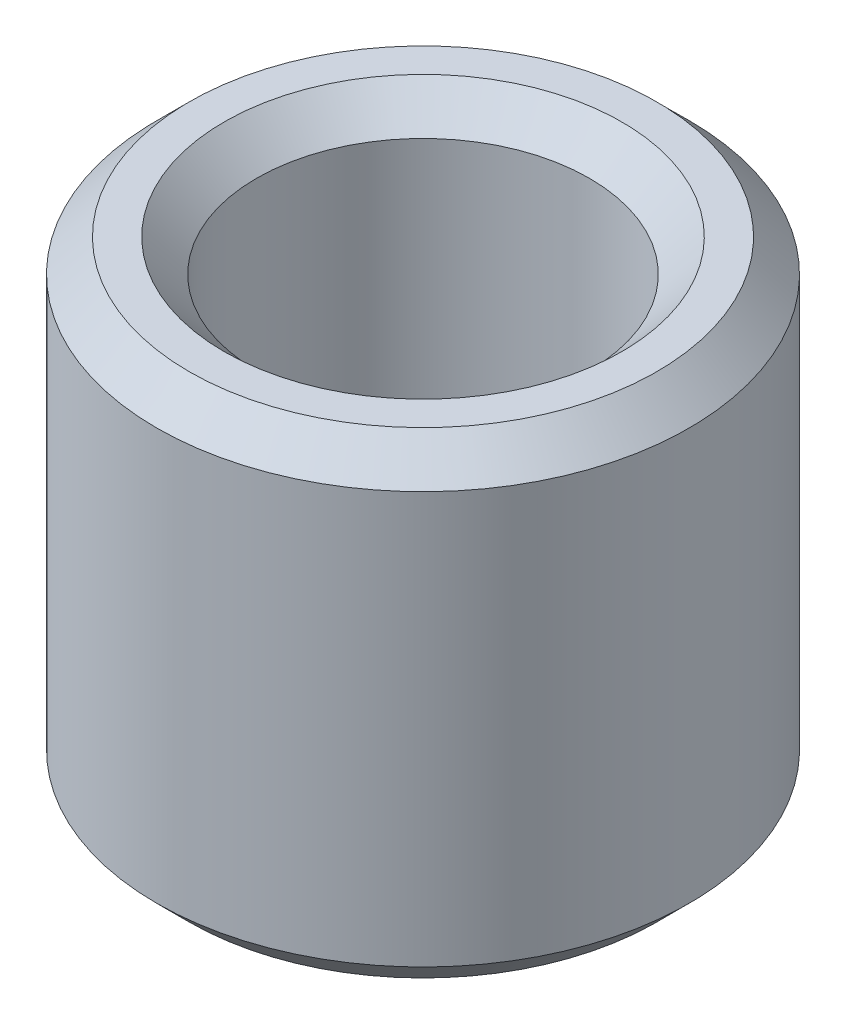
ISO-10303-21;
HEADER;
FILE_DESCRIPTION(('STEP AP214'),'2;1');
FILE_NAME('part.step','',(''),(''),'','','');
FILE_SCHEMA(('AUTOMOTIVE_DESIGN { 1 0 10303 214 1 1 1 1 }'));
ENDSEC;
DATA;
#1=APPLICATION_CONTEXT('core data for automotive mechanical design processes');
#2=APPLICATION_PROTOCOL_DEFINITION('international standard','automotive_design',2000,#1);
#3=PRODUCT_CONTEXT('',#1,'mechanical');
#4=PRODUCT('Part','Part','',(#3));
#5=PRODUCT_RELATED_PRODUCT_CATEGORY('part','',(#4));
#6=PRODUCT_DEFINITION_FORMATION('','',#4);
#7=PRODUCT_DEFINITION_CONTEXT('part definition',#1,'design');
#8=PRODUCT_DEFINITION('design','',#6,#7);
#9=PRODUCT_DEFINITION_SHAPE('','',#8);
#10=(LENGTH_UNIT() NAMED_UNIT(*) SI_UNIT(.MILLI.,.METRE.));
#11=(NAMED_UNIT(*) PLANE_ANGLE_UNIT() SI_UNIT($,.RADIAN.));
#12=(NAMED_UNIT(*) SI_UNIT($,.STERADIAN.) SOLID_ANGLE_UNIT());
#13=UNCERTAINTY_MEASURE_WITH_UNIT(LENGTH_MEASURE(1.E-05),#10,'distance_accuracy_value','');
#14=(GEOMETRIC_REPRESENTATION_CONTEXT(3) GLOBAL_UNCERTAINTY_ASSIGNED_CONTEXT((#13)) GLOBAL_UNIT_ASSIGNED_CONTEXT((#10,
#11,#12)) REPRESENTATION_CONTEXT('',''));
#15=CARTESIAN_POINT('',(0.,0.,0.));
#16=DIRECTION('',(0.,0.,1.));
#17=DIRECTION('',(1.,0.,0.));
#18=AXIS2_PLACEMENT_3D('',#15,#16,#17);
#19=CARTESIAN_POINT('',(0.,40.2782778000983,0.));
#20=DIRECTION('',(0.,-1.,0.));
#21=DIRECTION('',(0.,0.,-1.));
#22=AXIS2_PLACEMENT_3D('',#19,#20,#21);
#23=CYLINDRICAL_SURFACE('',#22,22.5);
#24=CARTESIAN_POINT('',(0.,2.74655692665027,0.));
#25=DIRECTION('',(0.,1.,0.));
#26=DIRECTION('',(0.,0.,1.));
#27=AXIS2_PLACEMENT_3D('',#24,#25,#26);
#28=CIRCLE('',#27,22.5);
#29=CARTESIAN_POINT('',(0.,2.74655692665027,22.5));
#30=VERTEX_POINT('',#29);
#31=EDGE_CURVE('E10',#30,#30,#28,.T.);
#32=ORIENTED_EDGE('',*,*,#31,.T.);
#33=EDGE_LOOP('',(#32));
#34=FACE_BOUND('',#33,.T.);
#35=CARTESIAN_POINT('',(0.,37.531720873448,0.));
#36=DIRECTION('',(0.,1.,0.));
#37=DIRECTION('',(0.,0.,1.));
#38=AXIS2_PLACEMENT_3D('',#35,#36,#37);
#39=CIRCLE('',#38,22.5);
#40=CARTESIAN_POINT('',(0.,37.531720873448,22.5));
#41=VERTEX_POINT('',#40);
#42=EDGE_CURVE('E50',#41,#41,#39,.F.);
#43=ORIENTED_EDGE('',*,*,#42,.T.);
#44=EDGE_LOOP('',(#43));
#45=FACE_BOUND('',#44,.T.);
#46=ADVANCED_FACE('F39',(#34,#45),#23,.T.);
#47=CARTESIAN_POINT('',(0.,40.2782778000983,0.));
#48=DIRECTION('',(0.,1.,0.));
#49=DIRECTION('',(0.,0.,1.));
#50=AXIS2_PLACEMENT_3D('',#47,#48,#49);
#51=PLANE('',#50);
#52=CARTESIAN_POINT('',(0.,40.2782778000983,0.));
#53=DIRECTION('',(0.,1.,0.));
#54=DIRECTION('',(0.,0.,1.));
#55=AXIS2_PLACEMENT_3D('',#52,#53,#54);
#56=CIRCLE('',#55,16.8094867861536);
#57=CARTESIAN_POINT('',(0.,40.2782778000983,16.8094867861536));
#58=VERTEX_POINT('',#57);
#59=EDGE_CURVE('E58',#58,#58,#56,.F.);
#60=ORIENTED_EDGE('',*,*,#59,.T.);
#61=EDGE_LOOP('',(#60));
#62=FACE_BOUND('',#61,.T.);
#63=CARTESIAN_POINT('',(0.,40.2782778000983,0.));
#64=DIRECTION('',(0.,1.,0.));
#65=DIRECTION('',(0.,0.,1.));
#66=AXIS2_PLACEMENT_3D('',#63,#64,#65);
#67=CIRCLE('',#66,19.7534430733497);
#68=CARTESIAN_POINT('',(0.,40.2782778000983,19.7534430733497));
#69=VERTEX_POINT('',#68);
#70=EDGE_CURVE('E61',#69,#69,#67,.T.);
#71=ORIENTED_EDGE('',*,*,#70,.T.);
#72=EDGE_LOOP('',(#71));
#73=FACE_BOUND('',#72,.T.);
#74=ADVANCED_FACE('F88',(#62,#73),#51,.T.);
#75=CARTESIAN_POINT('',(0.,0.,0.));
#76=DIRECTION('',(0.,1.,0.));
#77=DIRECTION('',(0.,0.,1.));
#78=AXIS2_PLACEMENT_3D('',#75,#76,#77);
#79=PLANE('',#78);
#80=CARTESIAN_POINT('',(0.,0.,0.));
#81=DIRECTION('',(0.,1.,0.));
#82=DIRECTION('',(0.,0.,1.));
#83=AXIS2_PLACEMENT_3D('',#80,#81,#82);
#84=CIRCLE('',#83,16.8094867861536);
#85=CARTESIAN_POINT('',(0.,0.,16.8094867861536));
#86=VERTEX_POINT('',#85);
#87=EDGE_CURVE('E51',#86,#86,#84,.T.);
#88=ORIENTED_EDGE('',*,*,#87,.T.);
#89=EDGE_LOOP('',(#88));
#90=FACE_BOUND('',#89,.T.);
#91=CARTESIAN_POINT('',(0.,0.,0.));
#92=DIRECTION('',(0.,1.,0.));
#93=DIRECTION('',(0.,0.,1.));
#94=AXIS2_PLACEMENT_3D('',#91,#92,#93);
#95=CIRCLE('',#94,19.7534430733497);
#96=CARTESIAN_POINT('',(0.,0.,19.7534430733497));
#97=VERTEX_POINT('',#96);
#98=EDGE_CURVE('E54',#97,#97,#95,.F.);
#99=ORIENTED_EDGE('',*,*,#98,.T.);
#100=EDGE_LOOP('',(#99));
#101=FACE_BOUND('',#100,.T.);
#102=ADVANCED_FACE('F83',(#90,#101),#79,.F.);
#103=CARTESIAN_POINT('',(0.,40.2782778000983,0.));
#104=DIRECTION('',(0.,-1.,0.));
#105=DIRECTION('',(0.,0.,-1.));
#106=AXIS2_PLACEMENT_3D('',#103,#104,#105);
#107=CYLINDRICAL_SURFACE('',#106,14.0629298595033);
#108=CARTESIAN_POINT('',(0.,37.531720873448,0.));
#109=DIRECTION('',(0.,1.,0.));
#110=DIRECTION('',(0.,0.,1.));
#111=AXIS2_PLACEMENT_3D('',#108,#109,#110);
#112=CIRCLE('',#111,14.0629298595033);
#113=CARTESIAN_POINT('',(0.,37.531720873448,14.0629298595033));
#114=VERTEX_POINT('',#113);
#115=EDGE_CURVE('E67',#114,#114,#112,.T.);
#116=ORIENTED_EDGE('',*,*,#115,.T.);
#117=EDGE_LOOP('',(#116));
#118=FACE_BOUND('',#117,.T.);
#119=CARTESIAN_POINT('',(0.,2.7465569266503,0.));
#120=DIRECTION('',(0.,1.,0.));
#121=DIRECTION('',(0.,0.,1.));
#122=AXIS2_PLACEMENT_3D('',#119,#120,#121);
#123=CIRCLE('',#122,14.0629298595033);
#124=CARTESIAN_POINT('',(0.,2.7465569266503,14.0629298595033));
#125=VERTEX_POINT('',#124);
#126=EDGE_CURVE('E69',#125,#125,#123,.F.);
#127=ORIENTED_EDGE('',*,*,#126,.T.);
#128=EDGE_LOOP('',(#127));
#129=FACE_BOUND('',#128,.T.);
#130=ADVANCED_FACE('F71',(#118,#129),#107,.F.);
#131=CARTESIAN_POINT('',(0.,37.531720873448,0.));
#132=DIRECTION('',(0.,1.,0.));
#133=DIRECTION('',(0.,0.,1.));
#134=AXIS2_PLACEMENT_3D('',#131,#132,#133);
#135=CONICAL_SURFACE('',#134,14.0629298595033,0.785398163397449);
#136=ORIENTED_EDGE('',*,*,#59,.F.);
#137=EDGE_LOOP('',(#136));
#138=FACE_BOUND('',#137,.T.);
#139=ORIENTED_EDGE('',*,*,#115,.F.);
#140=EDGE_LOOP('',(#139));
#141=FACE_BOUND('',#140,.T.);
#142=ADVANCED_FACE('F77',(#138,#141),#135,.F.);
#143=CARTESIAN_POINT('',(0.,0.,0.));
#144=DIRECTION('',(0.,-1.,0.));
#145=DIRECTION('',(0.,0.,-1.));
#146=AXIS2_PLACEMENT_3D('',#143,#144,#145);
#147=CONICAL_SURFACE('',#146,16.8094867861536,0.785398163397444);
#148=ORIENTED_EDGE('',*,*,#126,.F.);
#149=EDGE_LOOP('',(#148));
#150=FACE_BOUND('',#149,.T.);
#151=ORIENTED_EDGE('',*,*,#87,.F.);
#152=EDGE_LOOP('',(#151));
#153=FACE_BOUND('',#152,.T.);
#154=ADVANCED_FACE('F73',(#150,#153),#147,.F.);
#155=CARTESIAN_POINT('',(0.,2.74655692665027,0.));
#156=DIRECTION('',(0.,1.,0.));
#157=DIRECTION('',(0.,0.,1.));
#158=AXIS2_PLACEMENT_3D('',#155,#156,#157);
#159=CONICAL_SURFACE('',#158,22.5,0.785398163397452);
#160=ORIENTED_EDGE('',*,*,#98,.F.);
#161=EDGE_LOOP('',(#160));
#162=FACE_BOUND('',#161,.T.);
#163=ORIENTED_EDGE('',*,*,#31,.F.);
#164=EDGE_LOOP('',(#163));
#165=FACE_BOUND('',#164,.T.);
#166=ADVANCED_FACE('F76',(#162,#165),#159,.T.);
#167=CARTESIAN_POINT('',(0.,40.2782778000983,0.));
#168=DIRECTION('',(0.,-1.,0.));
#169=DIRECTION('',(0.,0.,-1.));
#170=AXIS2_PLACEMENT_3D('',#167,#168,#169);
#171=CONICAL_SURFACE('',#170,19.7534430733497,0.785398163397443);
#172=ORIENTED_EDGE('',*,*,#42,.F.);
#173=EDGE_LOOP('',(#172));
#174=FACE_BOUND('',#173,.T.);
#175=ORIENTED_EDGE('',*,*,#70,.F.);
#176=EDGE_LOOP('',(#175));
#177=FACE_BOUND('',#176,.T.);
#178=ADVANCED_FACE('F45',(#174,#177),#171,.T.);
#179=CLOSED_SHELL('',(#46,#74,#102,#130,#142,#154,#166,#178));
#180=MANIFOLD_SOLID_BREP('B2',#179);
#181=ADVANCED_BREP_SHAPE_REPRESENTATION('',(#18,#180),#14);
#182=SHAPE_DEFINITION_REPRESENTATION(#9,#181);
ENDSEC;
END-ISO-10303-21;
